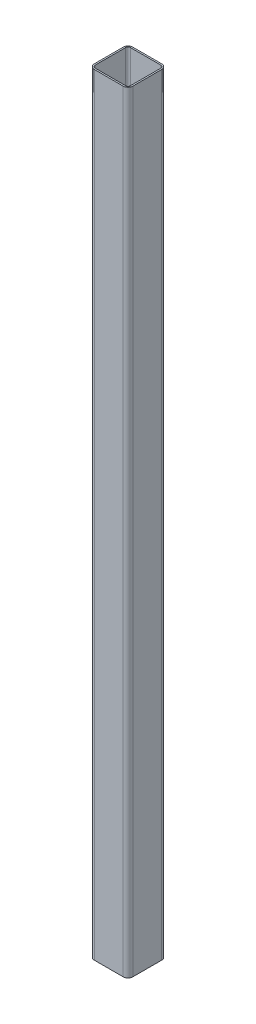
ISO-10303-21;
HEADER;
FILE_DESCRIPTION(('STEP AP214'),'2;1');
FILE_NAME('part.step','',(''),(''),'','','');
FILE_SCHEMA(('AUTOMOTIVE_DESIGN { 1 0 10303 214 1 1 1 1 }'));
ENDSEC;
DATA;
#1=APPLICATION_CONTEXT('core data for automotive mechanical design processes');
#2=APPLICATION_PROTOCOL_DEFINITION('international standard','automotive_design',2000,#1);
#3=PRODUCT_CONTEXT('',#1,'mechanical');
#4=PRODUCT('Part','Part','',(#3));
#5=PRODUCT_RELATED_PRODUCT_CATEGORY('part','',(#4));
#6=PRODUCT_DEFINITION_FORMATION('','',#4);
#7=PRODUCT_DEFINITION_CONTEXT('part definition',#1,'design');
#8=PRODUCT_DEFINITION('design','',#6,#7);
#9=PRODUCT_DEFINITION_SHAPE('','',#8);
#10=(LENGTH_UNIT() NAMED_UNIT(*) SI_UNIT(.MILLI.,.METRE.));
#11=(NAMED_UNIT(*) PLANE_ANGLE_UNIT() SI_UNIT($,.RADIAN.));
#12=(NAMED_UNIT(*) SI_UNIT($,.STERADIAN.) SOLID_ANGLE_UNIT());
#13=UNCERTAINTY_MEASURE_WITH_UNIT(LENGTH_MEASURE(1.E-05),#10,'distance_accuracy_value','');
#14=(GEOMETRIC_REPRESENTATION_CONTEXT(3) GLOBAL_UNCERTAINTY_ASSIGNED_CONTEXT((#13)) GLOBAL_UNIT_ASSIGNED_CONTEXT((#10,
#11,#12)) REPRESENTATION_CONTEXT('',''));
#15=CARTESIAN_POINT('',(0.,0.,0.));
#16=DIRECTION('',(0.,0.,1.));
#17=DIRECTION('',(1.,0.,0.));
#18=AXIS2_PLACEMENT_3D('',#15,#16,#17);
#19=CARTESIAN_POINT('',(28.575,762.,-28.575));
#20=DIRECTION('',(0.,1.,0.));
#21=DIRECTION('',(0.,0.,1.));
#22=AXIS2_PLACEMENT_3D('',#19,#20,#21);
#23=PLANE('',#22);
#24=CARTESIAN_POINT('',(28.575,762.,-28.575));
#25=DIRECTION('',(0.,1.,0.));
#26=DIRECTION('',(0.,0.,1.));
#27=AXIS2_PLACEMENT_3D('',#24,#25,#26);
#28=CIRCLE('',#27,9.525);
#29=CARTESIAN_POINT('',(38.1,762.,-28.575));
#30=VERTEX_POINT('',#29);
#31=CARTESIAN_POINT('',(28.575,762.,-38.1));
#32=VERTEX_POINT('',#31);
#33=EDGE_CURVE('E217',#30,#32,#28,.T.);
#34=ORIENTED_EDGE('',*,*,#33,.T.);
#35=DIRECTION('',(-1.,0.,0.));
#36=VECTOR('',#35,1.);
#37=CARTESIAN_POINT('',(28.575,762.,-38.1));
#38=LINE('',#37,#36);
#39=CARTESIAN_POINT('',(-28.575,762.,-38.1));
#40=VERTEX_POINT('',#39);
#41=EDGE_CURVE('E220',#32,#40,#38,.T.);
#42=ORIENTED_EDGE('',*,*,#41,.T.);
#43=CARTESIAN_POINT('',(-28.575,762.,-28.575));
#44=DIRECTION('',(0.,1.,0.));
#45=DIRECTION('',(0.,0.,1.));
#46=AXIS2_PLACEMENT_3D('',#43,#44,#45);
#47=CIRCLE('',#46,9.525);
#48=CARTESIAN_POINT('',(-38.1,762.,-28.575));
#49=VERTEX_POINT('',#48);
#50=EDGE_CURVE('E223',#40,#49,#47,.T.);
#51=ORIENTED_EDGE('',*,*,#50,.T.);
#52=DIRECTION('',(0.,0.,1.));
#53=VECTOR('',#52,1.);
#54=CARTESIAN_POINT('',(-38.1,762.,28.575));
#55=LINE('',#54,#53);
#56=CARTESIAN_POINT('',(-38.1,762.,28.575));
#57=VERTEX_POINT('',#56);
#58=EDGE_CURVE('E225',#49,#57,#55,.T.);
#59=ORIENTED_EDGE('',*,*,#58,.T.);
#60=CARTESIAN_POINT('',(-28.575,762.,28.575));
#61=DIRECTION('',(0.,1.,0.));
#62=DIRECTION('',(0.,0.,1.));
#63=AXIS2_PLACEMENT_3D('',#60,#61,#62);
#64=CIRCLE('',#63,9.52500000000001);
#65=CARTESIAN_POINT('',(-28.575,762.,38.1));
#66=VERTEX_POINT('',#65);
#67=EDGE_CURVE('E227',#57,#66,#64,.T.);
#68=ORIENTED_EDGE('',*,*,#67,.T.);
#69=DIRECTION('',(1.,0.,0.));
#70=VECTOR('',#69,1.);
#71=CARTESIAN_POINT('',(-28.575,762.,38.1));
#72=LINE('',#71,#70);
#73=CARTESIAN_POINT('',(28.575,762.,38.1));
#74=VERTEX_POINT('',#73);
#75=EDGE_CURVE('E229',#66,#74,#72,.T.);
#76=ORIENTED_EDGE('',*,*,#75,.T.);
#77=CARTESIAN_POINT('',(28.575,762.,28.575));
#78=DIRECTION('',(0.,1.,0.));
#79=DIRECTION('',(0.,0.,1.));
#80=AXIS2_PLACEMENT_3D('',#77,#78,#79);
#81=CIRCLE('',#80,9.525);
#82=CARTESIAN_POINT('',(38.1,762.,28.575));
#83=VERTEX_POINT('',#82);
#84=EDGE_CURVE('E231',#74,#83,#81,.T.);
#85=ORIENTED_EDGE('',*,*,#84,.T.);
#86=DIRECTION('',(0.,0.,-1.));
#87=VECTOR('',#86,1.);
#88=CARTESIAN_POINT('',(38.1,762.,-28.575));
#89=LINE('',#88,#87);
#90=EDGE_CURVE('E233',#83,#30,#89,.T.);
#91=ORIENTED_EDGE('',*,*,#90,.T.);
#92=EDGE_LOOP('',(#34,#42,#51,#59,#68,#76,#85,#91));
#93=FACE_BOUND('',#92,.T.);
#94=DIRECTION('',(0.,0.,1.));
#95=VECTOR('',#94,1.);
#96=CARTESIAN_POINT('',(-35.052,762.,30.2895));
#97=LINE('',#96,#95);
#98=CARTESIAN_POINT('',(-35.052,762.,-30.2895));
#99=VERTEX_POINT('',#98);
#100=CARTESIAN_POINT('',(-35.052,762.,30.2895));
#101=VERTEX_POINT('',#100);
#102=EDGE_CURVE('E157',#99,#101,#97,.T.);
#103=ORIENTED_EDGE('',*,*,#102,.F.);
#104=CARTESIAN_POINT('',(-30.2895,762.,-30.2895));
#105=DIRECTION('',(0.,1.,0.));
#106=DIRECTION('',(0.,0.,1.));
#107=AXIS2_PLACEMENT_3D('',#104,#105,#106);
#108=CIRCLE('',#107,4.7625);
#109=CARTESIAN_POINT('',(-30.2895,762.,-35.052));
#110=VERTEX_POINT('',#109);
#111=EDGE_CURVE('E149',#110,#99,#108,.T.);
#112=ORIENTED_EDGE('',*,*,#111,.F.);
#113=DIRECTION('',(-1.,0.,0.));
#114=VECTOR('',#113,1.);
#115=CARTESIAN_POINT('',(30.2895,762.,-35.052));
#116=LINE('',#115,#114);
#117=CARTESIAN_POINT('',(30.2895,762.,-35.052));
#118=VERTEX_POINT('',#117);
#119=EDGE_CURVE('E182',#118,#110,#116,.T.);
#120=ORIENTED_EDGE('',*,*,#119,.F.);
#121=CARTESIAN_POINT('',(30.2895,762.,-30.2895));
#122=DIRECTION('',(0.,1.,0.));
#123=DIRECTION('',(0.,0.,1.));
#124=AXIS2_PLACEMENT_3D('',#121,#122,#123);
#125=CIRCLE('',#124,4.7625);
#126=CARTESIAN_POINT('',(35.052,762.,-30.2895));
#127=VERTEX_POINT('',#126);
#128=EDGE_CURVE('E180',#127,#118,#125,.T.);
#129=ORIENTED_EDGE('',*,*,#128,.F.);
#130=DIRECTION('',(0.,0.,-1.));
#131=VECTOR('',#130,1.);
#132=CARTESIAN_POINT('',(35.052,762.,-30.2895));
#133=LINE('',#132,#131);
#134=CARTESIAN_POINT('',(35.052,762.,30.2895));
#135=VERTEX_POINT('',#134);
#136=EDGE_CURVE('E178',#135,#127,#133,.T.);
#137=ORIENTED_EDGE('',*,*,#136,.F.);
#138=CARTESIAN_POINT('',(30.2895,762.,30.2895));
#139=DIRECTION('',(0.,1.,0.));
#140=DIRECTION('',(0.,0.,1.));
#141=AXIS2_PLACEMENT_3D('',#138,#139,#140);
#142=CIRCLE('',#141,4.7625);
#143=CARTESIAN_POINT('',(30.2895,762.,35.052));
#144=VERTEX_POINT('',#143);
#145=EDGE_CURVE('E176',#144,#135,#142,.T.);
#146=ORIENTED_EDGE('',*,*,#145,.F.);
#147=DIRECTION('',(1.,0.,0.));
#148=VECTOR('',#147,1.);
#149=CARTESIAN_POINT('',(-30.2895,762.,35.052));
#150=LINE('',#149,#148);
#151=CARTESIAN_POINT('',(-30.2895,762.,35.052));
#152=VERTEX_POINT('',#151);
#153=EDGE_CURVE('E172',#152,#144,#150,.T.);
#154=ORIENTED_EDGE('',*,*,#153,.F.);
#155=CARTESIAN_POINT('',(-30.2895,762.,30.2895));
#156=DIRECTION('',(0.,1.,0.));
#157=DIRECTION('',(0.,0.,1.));
#158=AXIS2_PLACEMENT_3D('',#155,#156,#157);
#159=CIRCLE('',#158,4.7625);
#160=EDGE_CURVE('E170',#101,#152,#159,.T.);
#161=ORIENTED_EDGE('',*,*,#160,.F.);
#162=EDGE_LOOP('',(#103,#112,#120,#129,#137,#146,#154,#161));
#163=FACE_BOUND('',#162,.T.);
#164=ADVANCED_FACE('F35',(#93,#163),#23,.T.);
#165=CARTESIAN_POINT('',(28.575,-762.,-28.575));
#166=DIRECTION('',(0.,1.,0.));
#167=DIRECTION('',(0.,0.,1.));
#168=AXIS2_PLACEMENT_3D('',#165,#166,#167);
#169=PLANE('',#168);
#170=CARTESIAN_POINT('',(28.575,-762.,-28.575));
#171=DIRECTION('',(0.,1.,0.));
#172=DIRECTION('',(0.,0.,1.));
#173=AXIS2_PLACEMENT_3D('',#170,#171,#172);
#174=CIRCLE('',#173,9.525);
#175=CARTESIAN_POINT('',(38.1,-762.,-28.575));
#176=VERTEX_POINT('',#175);
#177=CARTESIAN_POINT('',(28.575,-762.,-38.1));
#178=VERTEX_POINT('',#177);
#179=EDGE_CURVE('E165',#176,#178,#174,.T.);
#180=ORIENTED_EDGE('',*,*,#179,.F.);
#181=DIRECTION('',(0.,0.,-1.));
#182=VECTOR('',#181,1.);
#183=CARTESIAN_POINT('',(38.1,-762.,-28.575));
#184=LINE('',#183,#182);
#185=CARTESIAN_POINT('',(38.1,-762.,28.575));
#186=VERTEX_POINT('',#185);
#187=EDGE_CURVE('E221',#186,#176,#184,.T.);
#188=ORIENTED_EDGE('',*,*,#187,.F.);
#189=CARTESIAN_POINT('',(28.575,-762.,28.575));
#190=DIRECTION('',(0.,1.,0.));
#191=DIRECTION('',(0.,0.,1.));
#192=AXIS2_PLACEMENT_3D('',#189,#190,#191);
#193=CIRCLE('',#192,9.525);
#194=CARTESIAN_POINT('',(28.575,-762.,38.1));
#195=VERTEX_POINT('',#194);
#196=EDGE_CURVE('E248',#195,#186,#193,.T.);
#197=ORIENTED_EDGE('',*,*,#196,.F.);
#198=DIRECTION('',(1.,0.,0.));
#199=VECTOR('',#198,1.);
#200=CARTESIAN_POINT('',(-28.575,-762.,38.1));
#201=LINE('',#200,#199);
#202=CARTESIAN_POINT('',(-28.575,-762.,38.1));
#203=VERTEX_POINT('',#202);
#204=EDGE_CURVE('E246',#203,#195,#201,.T.);
#205=ORIENTED_EDGE('',*,*,#204,.F.);
#206=CARTESIAN_POINT('',(-28.575,-762.,28.575));
#207=DIRECTION('',(0.,1.,0.));
#208=DIRECTION('',(0.,0.,1.));
#209=AXIS2_PLACEMENT_3D('',#206,#207,#208);
#210=CIRCLE('',#209,9.52500000000001);
#211=CARTESIAN_POINT('',(-38.1,-762.,28.575));
#212=VERTEX_POINT('',#211);
#213=EDGE_CURVE('E244',#212,#203,#210,.T.);
#214=ORIENTED_EDGE('',*,*,#213,.F.);
#215=DIRECTION('',(0.,0.,1.));
#216=VECTOR('',#215,1.);
#217=CARTESIAN_POINT('',(-38.1,-762.,28.575));
#218=LINE('',#217,#216);
#219=CARTESIAN_POINT('',(-38.1,-762.,-28.575));
#220=VERTEX_POINT('',#219);
#221=EDGE_CURVE('E242',#220,#212,#218,.T.);
#222=ORIENTED_EDGE('',*,*,#221,.F.);
#223=CARTESIAN_POINT('',(-28.575,-762.,-28.575));
#224=DIRECTION('',(0.,1.,0.));
#225=DIRECTION('',(0.,0.,1.));
#226=AXIS2_PLACEMENT_3D('',#223,#224,#225);
#227=CIRCLE('',#226,9.525);
#228=CARTESIAN_POINT('',(-28.575,-762.,-38.1));
#229=VERTEX_POINT('',#228);
#230=EDGE_CURVE('E240',#229,#220,#227,.T.);
#231=ORIENTED_EDGE('',*,*,#230,.F.);
#232=DIRECTION('',(-1.,0.,0.));
#233=VECTOR('',#232,1.);
#234=CARTESIAN_POINT('',(28.575,-762.,-38.1));
#235=LINE('',#234,#233);
#236=EDGE_CURVE('E238',#178,#229,#235,.T.);
#237=ORIENTED_EDGE('',*,*,#236,.F.);
#238=EDGE_LOOP('',(#180,#188,#197,#205,#214,#222,#231,#237));
#239=FACE_BOUND('',#238,.T.);
#240=CARTESIAN_POINT('',(-30.2895,-762.,-30.2895));
#241=DIRECTION('',(0.,1.,0.));
#242=DIRECTION('',(0.,0.,1.));
#243=AXIS2_PLACEMENT_3D('',#240,#241,#242);
#244=CIRCLE('',#243,4.7625);
#245=CARTESIAN_POINT('',(-30.2895,-762.,-35.052));
#246=VERTEX_POINT('',#245);
#247=CARTESIAN_POINT('',(-35.052,-762.,-30.2895));
#248=VERTEX_POINT('',#247);
#249=EDGE_CURVE('E59',#246,#248,#244,.T.);
#250=ORIENTED_EDGE('',*,*,#249,.T.);
#251=DIRECTION('',(0.,0.,1.));
#252=VECTOR('',#251,1.);
#253=CARTESIAN_POINT('',(-35.052,-762.,30.2895));
#254=LINE('',#253,#252);
#255=CARTESIAN_POINT('',(-35.052,-762.,30.2895));
#256=VERTEX_POINT('',#255);
#257=EDGE_CURVE('E164',#248,#256,#254,.T.);
#258=ORIENTED_EDGE('',*,*,#257,.T.);
#259=CARTESIAN_POINT('',(-30.2895,-762.,30.2895));
#260=DIRECTION('',(0.,1.,0.));
#261=DIRECTION('',(0.,0.,1.));
#262=AXIS2_PLACEMENT_3D('',#259,#260,#261);
#263=CIRCLE('',#262,4.7625);
#264=CARTESIAN_POINT('',(-30.2895,-762.,35.052));
#265=VERTEX_POINT('',#264);
#266=EDGE_CURVE('E186',#256,#265,#263,.T.);
#267=ORIENTED_EDGE('',*,*,#266,.T.);
#268=DIRECTION('',(1.,0.,0.));
#269=VECTOR('',#268,1.);
#270=CARTESIAN_POINT('',(-30.2895,-762.,35.052));
#271=LINE('',#270,#269);
#272=CARTESIAN_POINT('',(30.2895,-762.,35.052));
#273=VERTEX_POINT('',#272);
#274=EDGE_CURVE('E189',#265,#273,#271,.T.);
#275=ORIENTED_EDGE('',*,*,#274,.T.);
#276=CARTESIAN_POINT('',(30.2895,-762.,30.2895));
#277=DIRECTION('',(0.,1.,0.));
#278=DIRECTION('',(0.,0.,1.));
#279=AXIS2_PLACEMENT_3D('',#276,#277,#278);
#280=CIRCLE('',#279,4.7625);
#281=CARTESIAN_POINT('',(35.052,-762.,30.2895));
#282=VERTEX_POINT('',#281);
#283=EDGE_CURVE('E192',#273,#282,#280,.T.);
#284=ORIENTED_EDGE('',*,*,#283,.T.);
#285=DIRECTION('',(0.,0.,-1.));
#286=VECTOR('',#285,1.);
#287=CARTESIAN_POINT('',(35.052,-762.,-30.2895));
#288=LINE('',#287,#286);
#289=CARTESIAN_POINT('',(35.052,-762.,-30.2895));
#290=VERTEX_POINT('',#289);
#291=EDGE_CURVE('E195',#282,#290,#288,.T.);
#292=ORIENTED_EDGE('',*,*,#291,.T.);
#293=CARTESIAN_POINT('',(30.2895,-762.,-30.2895));
#294=DIRECTION('',(0.,1.,0.));
#295=DIRECTION('',(0.,0.,1.));
#296=AXIS2_PLACEMENT_3D('',#293,#294,#295);
#297=CIRCLE('',#296,4.7625);
#298=CARTESIAN_POINT('',(30.2895,-762.,-35.052));
#299=VERTEX_POINT('',#298);
#300=EDGE_CURVE('E198',#290,#299,#297,.T.);
#301=ORIENTED_EDGE('',*,*,#300,.T.);
#302=DIRECTION('',(-1.,0.,0.));
#303=VECTOR('',#302,1.);
#304=CARTESIAN_POINT('',(30.2895,-762.,-35.052));
#305=LINE('',#304,#303);
#306=EDGE_CURVE('E158',#299,#246,#305,.T.);
#307=ORIENTED_EDGE('',*,*,#306,.T.);
#308=EDGE_LOOP('',(#250,#258,#267,#275,#284,#292,#301,#307));
#309=FACE_BOUND('',#308,.T.);
#310=ADVANCED_FACE('F280',(#239,#309),#169,.F.);
#311=CARTESIAN_POINT('',(28.575,762.,-28.575));
#312=DIRECTION('',(0.,-1.,0.));
#313=DIRECTION('',(0.,0.,-1.));
#314=AXIS2_PLACEMENT_3D('',#311,#312,#313);
#315=CYLINDRICAL_SURFACE('',#314,9.525);
#316=ORIENTED_EDGE('',*,*,#179,.T.);
#317=DIRECTION('',(0.,-1.,0.));
#318=VECTOR('',#317,1.);
#319=CARTESIAN_POINT('',(28.575,762.,-38.1));
#320=LINE('',#319,#318);
#321=EDGE_CURVE('E11',#32,#178,#320,.T.);
#322=ORIENTED_EDGE('',*,*,#321,.F.);
#323=ORIENTED_EDGE('',*,*,#33,.F.);
#324=DIRECTION('',(0.,-1.,0.));
#325=VECTOR('',#324,1.);
#326=CARTESIAN_POINT('',(38.1,762.,-28.575));
#327=LINE('',#326,#325);
#328=EDGE_CURVE('E235',#30,#176,#327,.T.);
#329=ORIENTED_EDGE('',*,*,#328,.T.);
#330=EDGE_LOOP('',(#316,#322,#323,#329));
#331=FACE_BOUND('',#330,.T.);
#332=ADVANCED_FACE('F37',(#331),#315,.T.);
#333=CARTESIAN_POINT('',(28.575,762.,-38.1));
#334=DIRECTION('',(0.,0.,1.));
#335=DIRECTION('',(1.,0.,0.));
#336=AXIS2_PLACEMENT_3D('',#333,#334,#335);
#337=PLANE('',#336);
#338=ORIENTED_EDGE('',*,*,#236,.T.);
#339=DIRECTION('',(0.,-1.,0.));
#340=VECTOR('',#339,1.);
#341=CARTESIAN_POINT('',(-28.575,762.,-38.1));
#342=LINE('',#341,#340);
#343=EDGE_CURVE('E44',#40,#229,#342,.T.);
#344=ORIENTED_EDGE('',*,*,#343,.F.);
#345=ORIENTED_EDGE('',*,*,#41,.F.);
#346=ORIENTED_EDGE('',*,*,#321,.T.);
#347=EDGE_LOOP('',(#338,#344,#345,#346));
#348=FACE_BOUND('',#347,.T.);
#349=ADVANCED_FACE('F297',(#348),#337,.F.);
#350=CARTESIAN_POINT('',(-28.575,762.,-28.575));
#351=DIRECTION('',(0.,-1.,0.));
#352=DIRECTION('',(0.,0.,-1.));
#353=AXIS2_PLACEMENT_3D('',#350,#351,#352);
#354=CYLINDRICAL_SURFACE('',#353,9.525);
#355=ORIENTED_EDGE('',*,*,#230,.T.);
#356=DIRECTION('',(0.,-1.,0.));
#357=VECTOR('',#356,1.);
#358=CARTESIAN_POINT('',(-38.1,762.,-28.575));
#359=LINE('',#358,#357);
#360=EDGE_CURVE('E267',#49,#220,#359,.T.);
#361=ORIENTED_EDGE('',*,*,#360,.F.);
#362=ORIENTED_EDGE('',*,*,#50,.F.);
#363=ORIENTED_EDGE('',*,*,#343,.T.);
#364=EDGE_LOOP('',(#355,#361,#362,#363));
#365=FACE_BOUND('',#364,.T.);
#366=ADVANCED_FACE('F274',(#365),#354,.T.);
#367=CARTESIAN_POINT('',(-38.1,762.,28.575));
#368=DIRECTION('',(1.,0.,0.));
#369=DIRECTION('',(0.,0.,-1.));
#370=AXIS2_PLACEMENT_3D('',#367,#368,#369);
#371=PLANE('',#370);
#372=ORIENTED_EDGE('',*,*,#221,.T.);
#373=DIRECTION('',(0.,-1.,0.));
#374=VECTOR('',#373,1.);
#375=CARTESIAN_POINT('',(-38.1,762.,28.575));
#376=LINE('',#375,#374);
#377=EDGE_CURVE('E264',#57,#212,#376,.T.);
#378=ORIENTED_EDGE('',*,*,#377,.F.);
#379=ORIENTED_EDGE('',*,*,#58,.F.);
#380=ORIENTED_EDGE('',*,*,#360,.T.);
#381=EDGE_LOOP('',(#372,#378,#379,#380));
#382=FACE_BOUND('',#381,.T.);
#383=ADVANCED_FACE('F286',(#382),#371,.F.);
#384=CARTESIAN_POINT('',(-28.575,762.,28.575));
#385=DIRECTION('',(0.,-1.,0.));
#386=DIRECTION('',(0.,0.,-1.));
#387=AXIS2_PLACEMENT_3D('',#384,#385,#386);
#388=CYLINDRICAL_SURFACE('',#387,9.52500000000001);
#389=ORIENTED_EDGE('',*,*,#213,.T.);
#390=DIRECTION('',(0.,-1.,0.));
#391=VECTOR('',#390,1.);
#392=CARTESIAN_POINT('',(-28.575,762.,38.1));
#393=LINE('',#392,#391);
#394=EDGE_CURVE('E261',#66,#203,#393,.T.);
#395=ORIENTED_EDGE('',*,*,#394,.F.);
#396=ORIENTED_EDGE('',*,*,#67,.F.);
#397=ORIENTED_EDGE('',*,*,#377,.T.);
#398=EDGE_LOOP('',(#389,#395,#396,#397));
#399=FACE_BOUND('',#398,.T.);
#400=ADVANCED_FACE('F290',(#399),#388,.T.);
#401=CARTESIAN_POINT('',(-28.575,762.,38.1));
#402=DIRECTION('',(0.,0.,-1.));
#403=DIRECTION('',(-1.,0.,0.));
#404=AXIS2_PLACEMENT_3D('',#401,#402,#403);
#405=PLANE('',#404);
#406=ORIENTED_EDGE('',*,*,#204,.T.);
#407=DIRECTION('',(0.,-1.,0.));
#408=VECTOR('',#407,1.);
#409=CARTESIAN_POINT('',(28.575,762.,38.1));
#410=LINE('',#409,#408);
#411=EDGE_CURVE('E258',#74,#195,#410,.T.);
#412=ORIENTED_EDGE('',*,*,#411,.F.);
#413=ORIENTED_EDGE('',*,*,#75,.F.);
#414=ORIENTED_EDGE('',*,*,#394,.T.);
#415=EDGE_LOOP('',(#406,#412,#413,#414));
#416=FACE_BOUND('',#415,.T.);
#417=ADVANCED_FACE('F310',(#416),#405,.F.);
#418=CARTESIAN_POINT('',(28.575,762.,28.575));
#419=DIRECTION('',(0.,-1.,0.));
#420=DIRECTION('',(0.,0.,-1.));
#421=AXIS2_PLACEMENT_3D('',#418,#419,#420);
#422=CYLINDRICAL_SURFACE('',#421,9.525);
#423=ORIENTED_EDGE('',*,*,#196,.T.);
#424=DIRECTION('',(0.,-1.,0.));
#425=VECTOR('',#424,1.);
#426=CARTESIAN_POINT('',(38.1,762.,28.575));
#427=LINE('',#426,#425);
#428=EDGE_CURVE('E254',#83,#186,#427,.T.);
#429=ORIENTED_EDGE('',*,*,#428,.F.);
#430=ORIENTED_EDGE('',*,*,#84,.F.);
#431=ORIENTED_EDGE('',*,*,#411,.T.);
#432=EDGE_LOOP('',(#423,#429,#430,#431));
#433=FACE_BOUND('',#432,.T.);
#434=ADVANCED_FACE('F308',(#433),#422,.T.);
#435=CARTESIAN_POINT('',(38.1,762.,-28.575));
#436=DIRECTION('',(-1.,0.,0.));
#437=DIRECTION('',(0.,0.,1.));
#438=AXIS2_PLACEMENT_3D('',#435,#436,#437);
#439=PLANE('',#438);
#440=ORIENTED_EDGE('',*,*,#187,.T.);
#441=ORIENTED_EDGE('',*,*,#328,.F.);
#442=ORIENTED_EDGE('',*,*,#90,.F.);
#443=ORIENTED_EDGE('',*,*,#428,.T.);
#444=EDGE_LOOP('',(#440,#441,#442,#443));
#445=FACE_BOUND('',#444,.T.);
#446=ADVANCED_FACE('F303',(#445),#439,.F.);
#447=CARTESIAN_POINT('',(-30.2895,762.,-30.2895));
#448=DIRECTION('',(0.,-1.,0.));
#449=DIRECTION('',(0.,0.,-1.));
#450=AXIS2_PLACEMENT_3D('',#447,#448,#449);
#451=CYLINDRICAL_SURFACE('',#450,4.7625);
#452=ORIENTED_EDGE('',*,*,#249,.F.);
#453=DIRECTION('',(0.,-1.,0.));
#454=VECTOR('',#453,1.);
#455=CARTESIAN_POINT('',(-30.2895,762.,-35.052));
#456=LINE('',#455,#454);
#457=EDGE_CURVE('E153',#110,#246,#456,.T.);
#458=ORIENTED_EDGE('',*,*,#457,.F.);
#459=ORIENTED_EDGE('',*,*,#111,.T.);
#460=DIRECTION('',(0.,-1.,0.));
#461=VECTOR('',#460,1.);
#462=CARTESIAN_POINT('',(-35.052,762.,-30.2895));
#463=LINE('',#462,#461);
#464=EDGE_CURVE('E152',#99,#248,#463,.T.);
#465=ORIENTED_EDGE('',*,*,#464,.T.);
#466=EDGE_LOOP('',(#452,#458,#459,#465));
#467=FACE_BOUND('',#466,.T.);
#468=ADVANCED_FACE('F151',(#467),#451,.F.);
#469=CARTESIAN_POINT('',(-35.052,762.,30.2895));
#470=DIRECTION('',(1.,0.,0.));
#471=DIRECTION('',(0.,0.,-1.));
#472=AXIS2_PLACEMENT_3D('',#469,#470,#471);
#473=PLANE('',#472);
#474=ORIENTED_EDGE('',*,*,#257,.F.);
#475=ORIENTED_EDGE('',*,*,#464,.F.);
#476=ORIENTED_EDGE('',*,*,#102,.T.);
#477=DIRECTION('',(0.,-1.,0.));
#478=VECTOR('',#477,1.);
#479=CARTESIAN_POINT('',(-35.052,762.,30.2895));
#480=LINE('',#479,#478);
#481=EDGE_CURVE('E166',#101,#256,#480,.T.);
#482=ORIENTED_EDGE('',*,*,#481,.T.);
#483=EDGE_LOOP('',(#474,#475,#476,#482));
#484=FACE_BOUND('',#483,.T.);
#485=ADVANCED_FACE('F161',(#484),#473,.T.);
#486=CARTESIAN_POINT('',(-30.2895,762.,30.2895));
#487=DIRECTION('',(0.,-1.,0.));
#488=DIRECTION('',(0.,0.,-1.));
#489=AXIS2_PLACEMENT_3D('',#486,#487,#488);
#490=CYLINDRICAL_SURFACE('',#489,4.7625);
#491=ORIENTED_EDGE('',*,*,#266,.F.);
#492=ORIENTED_EDGE('',*,*,#481,.F.);
#493=ORIENTED_EDGE('',*,*,#160,.T.);
#494=DIRECTION('',(0.,-1.,0.));
#495=VECTOR('',#494,1.);
#496=CARTESIAN_POINT('',(-30.2895,762.,35.052));
#497=LINE('',#496,#495);
#498=EDGE_CURVE('E214',#152,#265,#497,.T.);
#499=ORIENTED_EDGE('',*,*,#498,.T.);
#500=EDGE_LOOP('',(#491,#492,#493,#499));
#501=FACE_BOUND('',#500,.T.);
#502=ADVANCED_FACE('F335',(#501),#490,.F.);
#503=CARTESIAN_POINT('',(-30.2895,762.,35.052));
#504=DIRECTION('',(0.,0.,-1.));
#505=DIRECTION('',(-1.,0.,0.));
#506=AXIS2_PLACEMENT_3D('',#503,#504,#505);
#507=PLANE('',#506);
#508=ORIENTED_EDGE('',*,*,#274,.F.);
#509=ORIENTED_EDGE('',*,*,#498,.F.);
#510=ORIENTED_EDGE('',*,*,#153,.T.);
#511=DIRECTION('',(0.,-1.,0.));
#512=VECTOR('',#511,1.);
#513=CARTESIAN_POINT('',(30.2895,762.,35.052));
#514=LINE('',#513,#512);
#515=EDGE_CURVE('E212',#144,#273,#514,.T.);
#516=ORIENTED_EDGE('',*,*,#515,.T.);
#517=EDGE_LOOP('',(#508,#509,#510,#516));
#518=FACE_BOUND('',#517,.T.);
#519=ADVANCED_FACE('F339',(#518),#507,.T.);
#520=CARTESIAN_POINT('',(30.2895,762.,30.2895));
#521=DIRECTION('',(0.,-1.,0.));
#522=DIRECTION('',(0.,0.,-1.));
#523=AXIS2_PLACEMENT_3D('',#520,#521,#522);
#524=CYLINDRICAL_SURFACE('',#523,4.7625);
#525=ORIENTED_EDGE('',*,*,#283,.F.);
#526=ORIENTED_EDGE('',*,*,#515,.F.);
#527=ORIENTED_EDGE('',*,*,#145,.T.);
#528=DIRECTION('',(0.,-1.,0.));
#529=VECTOR('',#528,1.);
#530=CARTESIAN_POINT('',(35.052,762.,30.2895));
#531=LINE('',#530,#529);
#532=EDGE_CURVE('E209',#135,#282,#531,.T.);
#533=ORIENTED_EDGE('',*,*,#532,.T.);
#534=EDGE_LOOP('',(#525,#526,#527,#533));
#535=FACE_BOUND('',#534,.T.);
#536=ADVANCED_FACE('F345',(#535),#524,.F.);
#537=CARTESIAN_POINT('',(35.052,762.,-30.2895));
#538=DIRECTION('',(-1.,0.,0.));
#539=DIRECTION('',(0.,0.,1.));
#540=AXIS2_PLACEMENT_3D('',#537,#538,#539);
#541=PLANE('',#540);
#542=ORIENTED_EDGE('',*,*,#291,.F.);
#543=ORIENTED_EDGE('',*,*,#532,.F.);
#544=ORIENTED_EDGE('',*,*,#136,.T.);
#545=DIRECTION('',(0.,-1.,0.));
#546=VECTOR('',#545,1.);
#547=CARTESIAN_POINT('',(35.052,762.,-30.2895));
#548=LINE('',#547,#546);
#549=EDGE_CURVE('E206',#127,#290,#548,.T.);
#550=ORIENTED_EDGE('',*,*,#549,.T.);
#551=EDGE_LOOP('',(#542,#543,#544,#550));
#552=FACE_BOUND('',#551,.T.);
#553=ADVANCED_FACE('F349',(#552),#541,.T.);
#554=CARTESIAN_POINT('',(30.2895,762.,-30.2895));
#555=DIRECTION('',(0.,-1.,0.));
#556=DIRECTION('',(0.,0.,-1.));
#557=AXIS2_PLACEMENT_3D('',#554,#555,#556);
#558=CYLINDRICAL_SURFACE('',#557,4.7625);
#559=ORIENTED_EDGE('',*,*,#300,.F.);
#560=ORIENTED_EDGE('',*,*,#549,.F.);
#561=ORIENTED_EDGE('',*,*,#128,.T.);
#562=DIRECTION('',(0.,-1.,0.));
#563=VECTOR('',#562,1.);
#564=CARTESIAN_POINT('',(30.2895,762.,-35.052));
#565=LINE('',#564,#563);
#566=EDGE_CURVE('E51',#118,#299,#565,.T.);
#567=ORIENTED_EDGE('',*,*,#566,.T.);
#568=EDGE_LOOP('',(#559,#560,#561,#567));
#569=FACE_BOUND('',#568,.T.);
#570=ADVANCED_FACE('F353',(#569),#558,.F.);
#571=CARTESIAN_POINT('',(30.2895,762.,-35.052));
#572=DIRECTION('',(0.,0.,1.));
#573=DIRECTION('',(1.,0.,0.));
#574=AXIS2_PLACEMENT_3D('',#571,#572,#573);
#575=PLANE('',#574);
#576=ORIENTED_EDGE('',*,*,#306,.F.);
#577=ORIENTED_EDGE('',*,*,#566,.F.);
#578=ORIENTED_EDGE('',*,*,#119,.T.);
#579=ORIENTED_EDGE('',*,*,#457,.T.);
#580=EDGE_LOOP('',(#576,#577,#578,#579));
#581=FACE_BOUND('',#580,.T.);
#582=ADVANCED_FACE('F357',(#581),#575,.T.);
#583=CLOSED_SHELL('',(#164,#310,#332,#349,#366,#383,#400,#417,#434,#446,#468,#485,#502,#519,
#536,#553,#570,#582));
#584=MANIFOLD_SOLID_BREP('B2',#583);
#585=ADVANCED_BREP_SHAPE_REPRESENTATION('',(#18,#584),#14);
#586=SHAPE_DEFINITION_REPRESENTATION(#9,#585);
ENDSEC;
END-ISO-10303-21;
